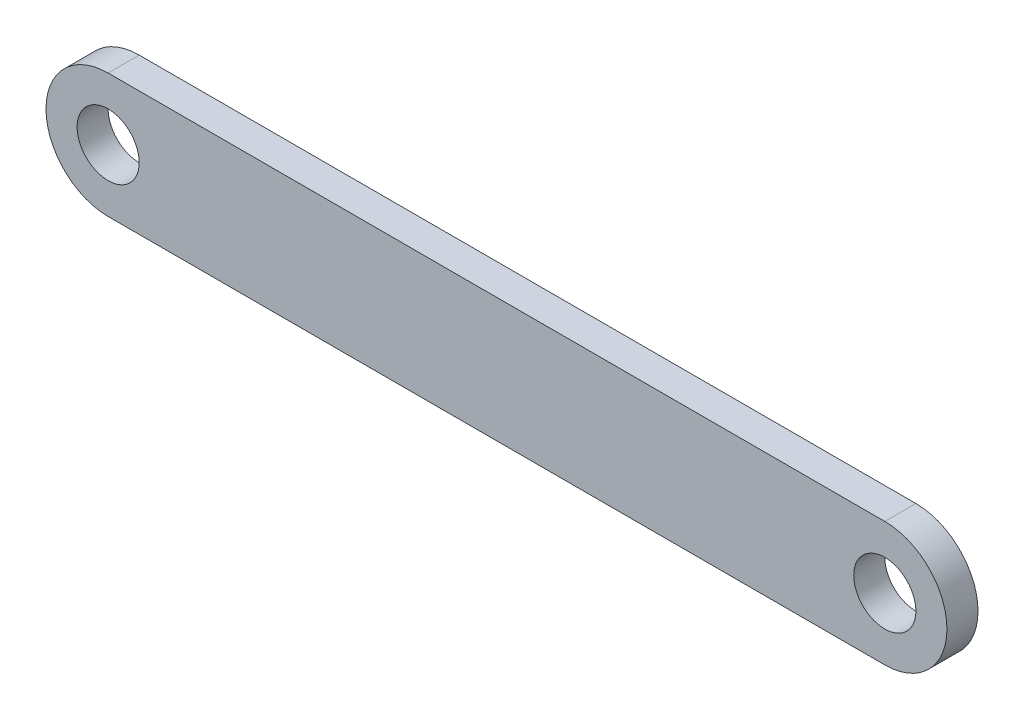
ISO-10303-21;
HEADER;
FILE_DESCRIPTION(('STEP AP214'),'2;1');
FILE_NAME('part.step','',(''),(''),'','','');
FILE_SCHEMA(('AUTOMOTIVE_DESIGN { 1 0 10303 214 1 1 1 1 }'));
ENDSEC;
DATA;
#1=APPLICATION_CONTEXT('core data for automotive mechanical design processes');
#2=APPLICATION_PROTOCOL_DEFINITION('international standard','automotive_design',2000,#1);
#3=PRODUCT_CONTEXT('',#1,'mechanical');
#4=PRODUCT('Part','Part','',(#3));
#5=PRODUCT_RELATED_PRODUCT_CATEGORY('part','',(#4));
#6=PRODUCT_DEFINITION_FORMATION('','',#4);
#7=PRODUCT_DEFINITION_CONTEXT('part definition',#1,'design');
#8=PRODUCT_DEFINITION('design','',#6,#7);
#9=PRODUCT_DEFINITION_SHAPE('','',#8);
#10=(LENGTH_UNIT() NAMED_UNIT(*) SI_UNIT(.MILLI.,.METRE.));
#11=(NAMED_UNIT(*) PLANE_ANGLE_UNIT() SI_UNIT($,.RADIAN.));
#12=(NAMED_UNIT(*) SI_UNIT($,.STERADIAN.) SOLID_ANGLE_UNIT());
#13=UNCERTAINTY_MEASURE_WITH_UNIT(LENGTH_MEASURE(1.E-05),#10,'distance_accuracy_value','');
#14=(GEOMETRIC_REPRESENTATION_CONTEXT(3) GLOBAL_UNCERTAINTY_ASSIGNED_CONTEXT((#13)) GLOBAL_UNIT_ASSIGNED_CONTEXT((#10,
#11,#12)) REPRESENTATION_CONTEXT('',''));
#15=CARTESIAN_POINT('',(0.,0.,0.));
#16=DIRECTION('',(0.,0.,1.));
#17=DIRECTION('',(1.,0.,0.));
#18=AXIS2_PLACEMENT_3D('',#15,#16,#17);
#19=CARTESIAN_POINT('',(0.,0.,2.));
#20=DIRECTION('',(0.,0.,1.));
#21=DIRECTION('',(1.,0.,0.));
#22=AXIS2_PLACEMENT_3D('',#19,#20,#21);
#23=PLANE('',#22);
#24=CARTESIAN_POINT('',(-50.,0.,2.));
#25=DIRECTION('',(0.,0.,1.));
#26=DIRECTION('',(1.,0.,0.));
#27=AXIS2_PLACEMENT_3D('',#24,#25,#26);
#28=CIRCLE('',#27,2.);
#29=CARTESIAN_POINT('',(-48.,0.,2.));
#30=VERTEX_POINT('',#29);
#31=EDGE_CURVE('E100',#30,#30,#28,.T.);
#32=ORIENTED_EDGE('',*,*,#31,.F.);
#33=EDGE_LOOP('',(#32));
#34=FACE_BOUND('',#33,.T.);
#35=CARTESIAN_POINT('',(0.,0.,2.));
#36=DIRECTION('',(0.,0.,1.));
#37=DIRECTION('',(1.,0.,0.));
#38=AXIS2_PLACEMENT_3D('',#35,#36,#37);
#39=CIRCLE('',#38,4.);
#40=CARTESIAN_POINT('',(0.,-4.,2.));
#41=VERTEX_POINT('',#40);
#42=CARTESIAN_POINT('',(0.,4.,2.));
#43=VERTEX_POINT('',#42);
#44=EDGE_CURVE('E85',#41,#43,#39,.T.);
#45=ORIENTED_EDGE('',*,*,#44,.T.);
#46=DIRECTION('',(-1.,0.,0.));
#47=VECTOR('',#46,1.);
#48=CARTESIAN_POINT('',(0.,4.,2.));
#49=LINE('',#48,#47);
#50=CARTESIAN_POINT('',(-50.,4.,2.));
#51=VERTEX_POINT('',#50);
#52=EDGE_CURVE('E80',#43,#51,#49,.T.);
#53=ORIENTED_EDGE('',*,*,#52,.T.);
#54=CARTESIAN_POINT('',(-50.,0.,2.));
#55=DIRECTION('',(0.,0.,1.));
#56=DIRECTION('',(1.,0.,0.));
#57=AXIS2_PLACEMENT_3D('',#54,#55,#56);
#58=CIRCLE('',#57,4.);
#59=CARTESIAN_POINT('',(-50.,-4.,2.));
#60=VERTEX_POINT('',#59);
#61=EDGE_CURVE('E83',#51,#60,#58,.T.);
#62=ORIENTED_EDGE('',*,*,#61,.T.);
#63=DIRECTION('',(1.,0.,0.));
#64=VECTOR('',#63,1.);
#65=CARTESIAN_POINT('',(0.,-4.,2.));
#66=LINE('',#65,#64);
#67=EDGE_CURVE('E50',#60,#41,#66,.T.);
#68=ORIENTED_EDGE('',*,*,#67,.T.);
#69=EDGE_LOOP('',(#45,#53,#62,#68));
#70=FACE_BOUND('',#69,.T.);
#71=CARTESIAN_POINT('',(0.,0.,2.));
#72=DIRECTION('',(0.,0.,1.));
#73=DIRECTION('',(-1.,0.,0.));
#74=AXIS2_PLACEMENT_3D('',#71,#72,#73);
#75=CIRCLE('',#74,1.99999999999999);
#76=CARTESIAN_POINT('',(-1.99999999999999,0.,2.));
#77=VERTEX_POINT('',#76);
#78=EDGE_CURVE('E115',#77,#77,#75,.T.);
#79=ORIENTED_EDGE('',*,*,#78,.F.);
#80=EDGE_LOOP('',(#79));
#81=FACE_BOUND('',#80,.T.);
#82=ADVANCED_FACE('F33',(#34,#70,#81),#23,.T.);
#83=CARTESIAN_POINT('',(0.,0.,0.));
#84=DIRECTION('',(0.,0.,1.));
#85=DIRECTION('',(1.,0.,0.));
#86=AXIS2_PLACEMENT_3D('',#83,#84,#85);
#87=PLANE('',#86);
#88=CARTESIAN_POINT('',(0.,0.,0.));
#89=DIRECTION('',(0.,0.,1.));
#90=DIRECTION('',(1.,0.,0.));
#91=AXIS2_PLACEMENT_3D('',#88,#89,#90);
#92=CIRCLE('',#91,4.);
#93=CARTESIAN_POINT('',(0.,-4.,0.));
#94=VERTEX_POINT('',#93);
#95=CARTESIAN_POINT('',(0.,4.,0.));
#96=VERTEX_POINT('',#95);
#97=EDGE_CURVE('E97',#94,#96,#92,.T.);
#98=ORIENTED_EDGE('',*,*,#97,.F.);
#99=DIRECTION('',(1.,0.,0.));
#100=VECTOR('',#99,1.);
#101=CARTESIAN_POINT('',(0.,-4.,0.));
#102=LINE('',#101,#100);
#103=CARTESIAN_POINT('',(-50.,-4.,0.));
#104=VERTEX_POINT('',#103);
#105=EDGE_CURVE('E73',#104,#94,#102,.T.);
#106=ORIENTED_EDGE('',*,*,#105,.F.);
#107=CARTESIAN_POINT('',(-50.,0.,0.));
#108=DIRECTION('',(0.,0.,1.));
#109=DIRECTION('',(1.,0.,0.));
#110=AXIS2_PLACEMENT_3D('',#107,#108,#109);
#111=CIRCLE('',#110,4.);
#112=CARTESIAN_POINT('',(-50.,4.,0.));
#113=VERTEX_POINT('',#112);
#114=EDGE_CURVE('E67',#113,#104,#111,.T.);
#115=ORIENTED_EDGE('',*,*,#114,.F.);
#116=DIRECTION('',(-1.,0.,0.));
#117=VECTOR('',#116,1.);
#118=CARTESIAN_POINT('',(0.,4.,0.));
#119=LINE('',#118,#117);
#120=EDGE_CURVE('E89',#96,#113,#119,.T.);
#121=ORIENTED_EDGE('',*,*,#120,.F.);
#122=EDGE_LOOP('',(#98,#106,#115,#121));
#123=FACE_BOUND('',#122,.T.);
#124=CARTESIAN_POINT('',(-50.,0.,0.));
#125=DIRECTION('',(0.,0.,1.));
#126=DIRECTION('',(1.,0.,0.));
#127=AXIS2_PLACEMENT_3D('',#124,#125,#126);
#128=CIRCLE('',#127,2.);
#129=CARTESIAN_POINT('',(-48.,0.,0.));
#130=VERTEX_POINT('',#129);
#131=EDGE_CURVE('E112',#130,#130,#128,.T.);
#132=ORIENTED_EDGE('',*,*,#131,.T.);
#133=EDGE_LOOP('',(#132));
#134=FACE_BOUND('',#133,.T.);
#135=CARTESIAN_POINT('',(0.,0.,0.));
#136=DIRECTION('',(0.,0.,1.));
#137=DIRECTION('',(-1.,0.,0.));
#138=AXIS2_PLACEMENT_3D('',#135,#136,#137);
#139=CIRCLE('',#138,1.99999999999999);
#140=CARTESIAN_POINT('',(-1.99999999999999,0.,0.));
#141=VERTEX_POINT('',#140);
#142=EDGE_CURVE('E118',#141,#141,#139,.T.);
#143=ORIENTED_EDGE('',*,*,#142,.T.);
#144=EDGE_LOOP('',(#143));
#145=FACE_BOUND('',#144,.T.);
#146=ADVANCED_FACE('F108',(#123,#134,#145),#87,.F.);
#147=CARTESIAN_POINT('',(0.,0.,2.));
#148=DIRECTION('',(0.,0.,-1.));
#149=DIRECTION('',(-1.,0.,0.));
#150=AXIS2_PLACEMENT_3D('',#147,#148,#149);
#151=CYLINDRICAL_SURFACE('',#150,4.);
#152=ORIENTED_EDGE('',*,*,#97,.T.);
#153=DIRECTION('',(0.,0.,-1.));
#154=VECTOR('',#153,1.);
#155=CARTESIAN_POINT('',(0.,4.,2.));
#156=LINE('',#155,#154);
#157=EDGE_CURVE('E11',#43,#96,#156,.T.);
#158=ORIENTED_EDGE('',*,*,#157,.F.);
#159=ORIENTED_EDGE('',*,*,#44,.F.);
#160=DIRECTION('',(0.,0.,-1.));
#161=VECTOR('',#160,1.);
#162=CARTESIAN_POINT('',(0.,-4.,2.));
#163=LINE('',#162,#161);
#164=EDGE_CURVE('E93',#41,#94,#163,.T.);
#165=ORIENTED_EDGE('',*,*,#164,.T.);
#166=EDGE_LOOP('',(#152,#158,#159,#165));
#167=FACE_BOUND('',#166,.T.);
#168=ADVANCED_FACE('F35',(#167),#151,.T.);
#169=CARTESIAN_POINT('',(0.,4.,2.));
#170=DIRECTION('',(0.,-1.,0.));
#171=DIRECTION('',(1.,0.,0.));
#172=AXIS2_PLACEMENT_3D('',#169,#170,#171);
#173=PLANE('',#172);
#174=ORIENTED_EDGE('',*,*,#120,.T.);
#175=DIRECTION('',(0.,0.,-1.));
#176=VECTOR('',#175,1.);
#177=CARTESIAN_POINT('',(-50.,4.,2.));
#178=LINE('',#177,#176);
#179=EDGE_CURVE('E42',#51,#113,#178,.T.);
#180=ORIENTED_EDGE('',*,*,#179,.F.);
#181=ORIENTED_EDGE('',*,*,#52,.F.);
#182=ORIENTED_EDGE('',*,*,#157,.T.);
#183=EDGE_LOOP('',(#174,#180,#181,#182));
#184=FACE_BOUND('',#183,.T.);
#185=ADVANCED_FACE('F88',(#184),#173,.F.);
#186=CARTESIAN_POINT('',(-50.,0.,2.));
#187=DIRECTION('',(0.,0.,-1.));
#188=DIRECTION('',(-1.,0.,0.));
#189=AXIS2_PLACEMENT_3D('',#186,#187,#188);
#190=CYLINDRICAL_SURFACE('',#189,4.);
#191=ORIENTED_EDGE('',*,*,#114,.T.);
#192=DIRECTION('',(0.,0.,-1.));
#193=VECTOR('',#192,1.);
#194=CARTESIAN_POINT('',(-50.,-4.,2.));
#195=LINE('',#194,#193);
#196=EDGE_CURVE('E90',#60,#104,#195,.T.);
#197=ORIENTED_EDGE('',*,*,#196,.F.);
#198=ORIENTED_EDGE('',*,*,#61,.F.);
#199=ORIENTED_EDGE('',*,*,#179,.T.);
#200=EDGE_LOOP('',(#191,#197,#198,#199));
#201=FACE_BOUND('',#200,.T.);
#202=ADVANCED_FACE('F91',(#201),#190,.T.);
#203=CARTESIAN_POINT('',(0.,-4.,2.));
#204=DIRECTION('',(0.,1.,0.));
#205=DIRECTION('',(-1.,0.,0.));
#206=AXIS2_PLACEMENT_3D('',#203,#204,#205);
#207=PLANE('',#206);
#208=ORIENTED_EDGE('',*,*,#105,.T.);
#209=ORIENTED_EDGE('',*,*,#164,.F.);
#210=ORIENTED_EDGE('',*,*,#67,.F.);
#211=ORIENTED_EDGE('',*,*,#196,.T.);
#212=EDGE_LOOP('',(#208,#209,#210,#211));
#213=FACE_BOUND('',#212,.T.);
#214=ADVANCED_FACE('F105',(#213),#207,.F.);
#215=CARTESIAN_POINT('',(-50.,0.,2.));
#216=DIRECTION('',(0.,0.,-1.));
#217=DIRECTION('',(-1.,0.,0.));
#218=AXIS2_PLACEMENT_3D('',#215,#216,#217);
#219=CYLINDRICAL_SURFACE('',#218,2.);
#220=ORIENTED_EDGE('',*,*,#31,.T.);
#221=EDGE_LOOP('',(#220));
#222=FACE_BOUND('',#221,.T.);
#223=ORIENTED_EDGE('',*,*,#131,.F.);
#224=EDGE_LOOP('',(#223));
#225=FACE_BOUND('',#224,.T.);
#226=ADVANCED_FACE('F135',(#222,#225),#219,.F.);
#227=CARTESIAN_POINT('',(0.,0.,2.));
#228=DIRECTION('',(0.,0.,-1.));
#229=DIRECTION('',(-1.,0.,0.));
#230=AXIS2_PLACEMENT_3D('',#227,#228,#229);
#231=CYLINDRICAL_SURFACE('',#230,1.99999999999999);
#232=ORIENTED_EDGE('',*,*,#78,.T.);
#233=EDGE_LOOP('',(#232));
#234=FACE_BOUND('',#233,.T.);
#235=ORIENTED_EDGE('',*,*,#142,.F.);
#236=EDGE_LOOP('',(#235));
#237=FACE_BOUND('',#236,.T.);
#238=ADVANCED_FACE('F124',(#234,#237),#231,.F.);
#239=CLOSED_SHELL('',(#82,#146,#168,#185,#202,#214,#226,#238));
#240=MANIFOLD_SOLID_BREP('B2',#239);
#241=ADVANCED_BREP_SHAPE_REPRESENTATION('',(#18,#240),#14);
#242=SHAPE_DEFINITION_REPRESENTATION(#9,#241);
ENDSEC;
END-ISO-10303-21;
